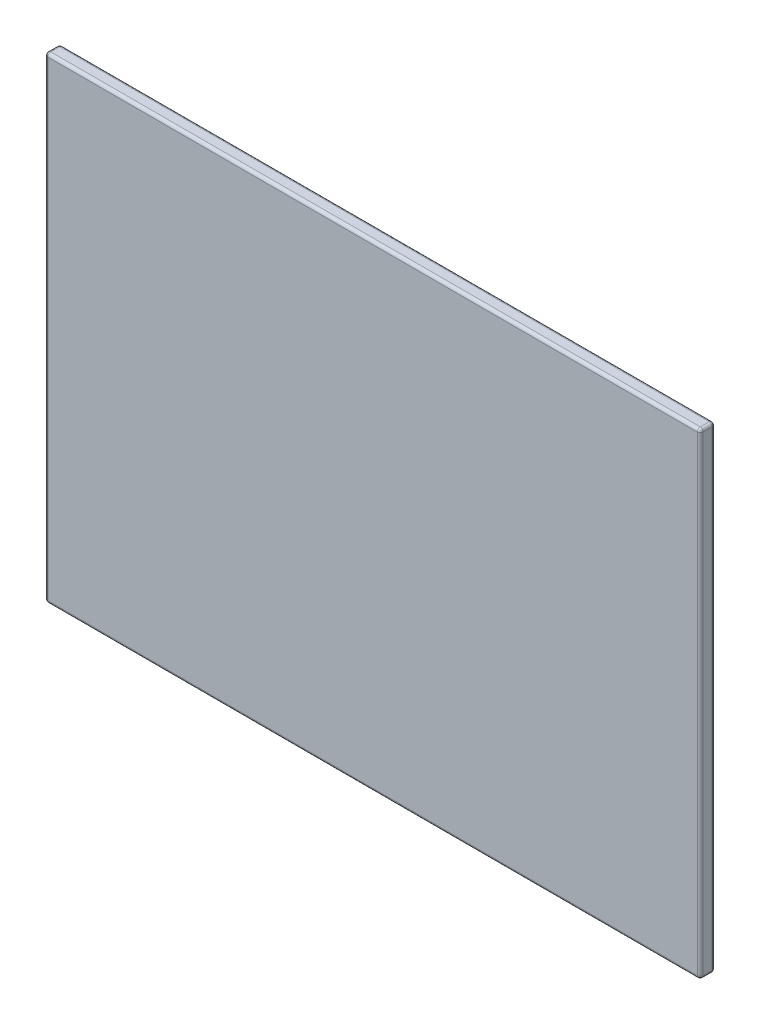
ISO-10303-21;
HEADER;
FILE_DESCRIPTION(('STEP AP214'),'2;1');
FILE_NAME('part.step','',(''),(''),'','','');
FILE_SCHEMA(('AUTOMOTIVE_DESIGN { 1 0 10303 214 1 1 1 1 }'));
ENDSEC;
DATA;
#1=APPLICATION_CONTEXT('core data for automotive mechanical design processes');
#2=APPLICATION_PROTOCOL_DEFINITION('international standard','automotive_design',2000,#1);
#3=PRODUCT_CONTEXT('',#1,'mechanical');
#4=PRODUCT('Part','Part','',(#3));
#5=PRODUCT_RELATED_PRODUCT_CATEGORY('part','',(#4));
#6=PRODUCT_DEFINITION_FORMATION('','',#4);
#7=PRODUCT_DEFINITION_CONTEXT('part definition',#1,'design');
#8=PRODUCT_DEFINITION('design','',#6,#7);
#9=PRODUCT_DEFINITION_SHAPE('','',#8);
#10=(LENGTH_UNIT() NAMED_UNIT(*) SI_UNIT(.MILLI.,.METRE.));
#11=(NAMED_UNIT(*) PLANE_ANGLE_UNIT() SI_UNIT($,.RADIAN.));
#12=(NAMED_UNIT(*) SI_UNIT($,.STERADIAN.) SOLID_ANGLE_UNIT());
#13=UNCERTAINTY_MEASURE_WITH_UNIT(LENGTH_MEASURE(1.E-05),#10,'distance_accuracy_value','');
#14=(GEOMETRIC_REPRESENTATION_CONTEXT(3) GLOBAL_UNCERTAINTY_ASSIGNED_CONTEXT((#13)) GLOBAL_UNIT_ASSIGNED_CONTEXT((#10,
#11,#12)) REPRESENTATION_CONTEXT('',''));
#15=CARTESIAN_POINT('',(0.,0.,0.));
#16=DIRECTION('',(0.,0.,1.));
#17=DIRECTION('',(1.,0.,0.));
#18=AXIS2_PLACEMENT_3D('',#15,#16,#17);
#19=CARTESIAN_POINT('',(-1.09,-0.79,0.04));
#20=DIRECTION('',(-0.577350269189626,-0.577350269189626,0.577350269189626));
#21=DIRECTION('',(0.,0.707106781186548,0.707106781186548));
#22=AXIS2_PLACEMENT_3D('',#19,#20,#21);
#23=SPHERICAL_SURFACE('',#22,0.01);
#24=CARTESIAN_POINT('',(-1.0957735026919,-0.795773502691896,0.0457735026918962));
#25=VERTEX_POINT('',#24);
#26=VERTEX_LOOP('',#25);
#27=FACE_BOUND('',#26,.T.);
#28=CARTESIAN_POINT('',(-1.09,-0.79,0.04));
#29=DIRECTION('',(0.,0.,1.));
#30=DIRECTION('',(1.,0.,0.));
#31=AXIS2_PLACEMENT_3D('',#28,#29,#30);
#32=CIRCLE('',#31,0.01);
#33=CARTESIAN_POINT('',(-1.09,-0.8,0.04));
#34=VERTEX_POINT('',#33);
#35=CARTESIAN_POINT('',(-1.1,-0.79,0.04));
#36=VERTEX_POINT('',#35);
#37=EDGE_CURVE('E112',#34,#36,#32,.F.);
#38=ORIENTED_EDGE('',*,*,#37,.F.);
#39=CARTESIAN_POINT('',(-1.09,-0.79,0.04));
#40=DIRECTION('',(1.,0.,0.));
#41=DIRECTION('',(0.,1.,0.));
#42=AXIS2_PLACEMENT_3D('',#39,#40,#41);
#43=CIRCLE('',#42,0.01);
#44=CARTESIAN_POINT('',(-1.09,-0.79,0.05));
#45=VERTEX_POINT('',#44);
#46=EDGE_CURVE('E123',#45,#34,#43,.T.);
#47=ORIENTED_EDGE('',*,*,#46,.F.);
#48=CARTESIAN_POINT('',(-1.09,-0.79,0.04));
#49=DIRECTION('',(0.,-1.,0.));
#50=DIRECTION('',(1.,0.,0.));
#51=AXIS2_PLACEMENT_3D('',#48,#49,#50);
#52=CIRCLE('',#51,0.01);
#53=EDGE_CURVE('E21',#36,#45,#52,.F.);
#54=ORIENTED_EDGE('',*,*,#53,.F.);
#55=EDGE_LOOP('',(#38,#47,#54));
#56=FACE_BOUND('',#55,.T.);
#57=ADVANCED_FACE('F17',(#27,#56),#23,.T.);
#58=CARTESIAN_POINT('',(1.09,-0.79,0.04));
#59=DIRECTION('',(0.577350269189626,-0.577350269189626,0.577350269189626));
#60=DIRECTION('',(0.,0.707106781186548,0.707106781186548));
#61=AXIS2_PLACEMENT_3D('',#58,#59,#60);
#62=SPHERICAL_SURFACE('',#61,0.01);
#63=CARTESIAN_POINT('',(1.0957735026919,-0.795773502691896,0.0457735026918962));
#64=VERTEX_POINT('',#63);
#65=VERTEX_LOOP('',#64);
#66=FACE_BOUND('',#65,.T.);
#67=CARTESIAN_POINT('',(1.09,-0.79,0.04));
#68=DIRECTION('',(0.,0.,1.));
#69=DIRECTION('',(1.,0.,0.));
#70=AXIS2_PLACEMENT_3D('',#67,#68,#69);
#71=CIRCLE('',#70,0.01);
#72=CARTESIAN_POINT('',(1.1,-0.79,0.04));
#73=VERTEX_POINT('',#72);
#74=CARTESIAN_POINT('',(1.09,-0.8,0.04));
#75=VERTEX_POINT('',#74);
#76=EDGE_CURVE('E224',#73,#75,#71,.F.);
#77=ORIENTED_EDGE('',*,*,#76,.F.);
#78=CARTESIAN_POINT('',(1.09,-0.79,0.04));
#79=DIRECTION('',(0.,1.,0.));
#80=DIRECTION('',(-1.,0.,0.));
#81=AXIS2_PLACEMENT_3D('',#78,#79,#80);
#82=CIRCLE('',#81,0.01);
#83=CARTESIAN_POINT('',(1.09,-0.79,0.05));
#84=VERTEX_POINT('',#83);
#85=EDGE_CURVE('E175',#84,#73,#82,.T.);
#86=ORIENTED_EDGE('',*,*,#85,.F.);
#87=CARTESIAN_POINT('',(1.09,-0.79,0.04));
#88=DIRECTION('',(1.,0.,0.));
#89=DIRECTION('',(0.,1.,0.));
#90=AXIS2_PLACEMENT_3D('',#87,#88,#89);
#91=CIRCLE('',#90,0.01);
#92=EDGE_CURVE('E180',#75,#84,#91,.F.);
#93=ORIENTED_EDGE('',*,*,#92,.F.);
#94=EDGE_LOOP('',(#77,#86,#93));
#95=FACE_BOUND('',#94,.T.);
#96=ADVANCED_FACE('F167',(#66,#95),#62,.T.);
#97=CARTESIAN_POINT('',(-1.09,0.79,0.04));
#98=DIRECTION('',(-0.577350269189626,0.577350269189626,0.577350269189626));
#99=DIRECTION('',(0.,0.707106781186548,-0.707106781186548));
#100=AXIS2_PLACEMENT_3D('',#97,#98,#99);
#101=SPHERICAL_SURFACE('',#100,0.01);
#102=CARTESIAN_POINT('',(-1.0957735026919,0.795773502691896,0.0457735026918962));
#103=VERTEX_POINT('',#102);
#104=VERTEX_LOOP('',#103);
#105=FACE_BOUND('',#104,.T.);
#106=CARTESIAN_POINT('',(-1.09,0.79,0.04));
#107=DIRECTION('',(0.,0.,1.));
#108=DIRECTION('',(1.,0.,0.));
#109=AXIS2_PLACEMENT_3D('',#106,#107,#108);
#110=CIRCLE('',#109,0.01);
#111=CARTESIAN_POINT('',(-1.1,0.79,0.04));
#112=VERTEX_POINT('',#111);
#113=CARTESIAN_POINT('',(-1.09,0.8,0.04));
#114=VERTEX_POINT('',#113);
#115=EDGE_CURVE('E222',#112,#114,#110,.F.);
#116=ORIENTED_EDGE('',*,*,#115,.F.);
#117=CARTESIAN_POINT('',(-1.09,0.79,0.04));
#118=DIRECTION('',(0.,-1.,0.));
#119=DIRECTION('',(1.,0.,0.));
#120=AXIS2_PLACEMENT_3D('',#117,#118,#119);
#121=CIRCLE('',#120,0.01);
#122=CARTESIAN_POINT('',(-1.09,0.79,0.05));
#123=VERTEX_POINT('',#122);
#124=EDGE_CURVE('E141',#123,#112,#121,.T.);
#125=ORIENTED_EDGE('',*,*,#124,.F.);
#126=CARTESIAN_POINT('',(-1.09,0.79,0.04));
#127=DIRECTION('',(-1.,0.,0.));
#128=DIRECTION('',(0.,-1.,0.));
#129=AXIS2_PLACEMENT_3D('',#126,#127,#128);
#130=CIRCLE('',#129,0.01);
#131=EDGE_CURVE('E219',#114,#123,#130,.F.);
#132=ORIENTED_EDGE('',*,*,#131,.F.);
#133=EDGE_LOOP('',(#116,#125,#132));
#134=FACE_BOUND('',#133,.T.);
#135=ADVANCED_FACE('F164',(#105,#134),#101,.T.);
#136=CARTESIAN_POINT('',(0.,0.,0.05));
#137=DIRECTION('',(0.,0.,1.));
#138=DIRECTION('',(1.,0.,0.));
#139=AXIS2_PLACEMENT_3D('',#136,#137,#138);
#140=PLANE('',#139);
#141=DIRECTION('',(0.,1.,0.));
#142=VECTOR('',#141,1.);
#143=CARTESIAN_POINT('',(1.09,-0.4,0.05));
#144=LINE('',#143,#142);
#145=CARTESIAN_POINT('',(1.09,0.79,0.05));
#146=VERTEX_POINT('',#145);
#147=EDGE_CURVE('E173',#146,#84,#144,.F.);
#148=ORIENTED_EDGE('',*,*,#147,.F.);
#149=DIRECTION('',(-1.,0.,0.));
#150=VECTOR('',#149,1.);
#151=CARTESIAN_POINT('',(0.55,0.79,0.05));
#152=LINE('',#151,#150);
#153=EDGE_CURVE('E152',#123,#146,#152,.F.);
#154=ORIENTED_EDGE('',*,*,#153,.F.);
#155=DIRECTION('',(0.,-1.,0.));
#156=VECTOR('',#155,1.);
#157=CARTESIAN_POINT('',(-1.09,0.4,0.05));
#158=LINE('',#157,#156);
#159=EDGE_CURVE('E138',#45,#123,#158,.F.);
#160=ORIENTED_EDGE('',*,*,#159,.F.);
#161=DIRECTION('',(1.,0.,0.));
#162=VECTOR('',#161,1.);
#163=CARTESIAN_POINT('',(-0.55,-0.79,0.05));
#164=LINE('',#163,#162);
#165=EDGE_CURVE('E178',#84,#45,#164,.F.);
#166=ORIENTED_EDGE('',*,*,#165,.F.);
#167=EDGE_LOOP('',(#148,#154,#160,#166));
#168=FACE_BOUND('',#167,.T.);
#169=ADVANCED_FACE('F159',(#168),#140,.T.);
#170=CARTESIAN_POINT('',(1.09,0.79,0.04));
#171=DIRECTION('',(0.577350269189626,0.577350269189626,0.577350269189626));
#172=DIRECTION('',(0.,0.707106781186548,-0.707106781186548));
#173=AXIS2_PLACEMENT_3D('',#170,#171,#172);
#174=SPHERICAL_SURFACE('',#173,0.01);
#175=CARTESIAN_POINT('',(1.0957735026919,0.795773502691896,0.0457735026918962));
#176=VERTEX_POINT('',#175);
#177=VERTEX_LOOP('',#176);
#178=FACE_BOUND('',#177,.T.);
#179=CARTESIAN_POINT('',(1.09,0.79,0.04));
#180=DIRECTION('',(0.,0.,1.));
#181=DIRECTION('',(1.,0.,0.));
#182=AXIS2_PLACEMENT_3D('',#179,#180,#181);
#183=CIRCLE('',#182,0.01);
#184=CARTESIAN_POINT('',(1.09,0.8,0.04));
#185=VERTEX_POINT('',#184);
#186=CARTESIAN_POINT('',(1.1,0.79,0.04));
#187=VERTEX_POINT('',#186);
#188=EDGE_CURVE('E133',#185,#187,#183,.F.);
#189=ORIENTED_EDGE('',*,*,#188,.F.);
#190=CARTESIAN_POINT('',(1.09,0.79,0.04));
#191=DIRECTION('',(-1.,0.,0.));
#192=DIRECTION('',(0.,-1.,0.));
#193=AXIS2_PLACEMENT_3D('',#190,#191,#192);
#194=CIRCLE('',#193,0.01);
#195=EDGE_CURVE('E217',#146,#185,#194,.T.);
#196=ORIENTED_EDGE('',*,*,#195,.F.);
#197=CARTESIAN_POINT('',(1.09,0.79,0.04));
#198=DIRECTION('',(0.,1.,0.));
#199=DIRECTION('',(-1.,0.,0.));
#200=AXIS2_PLACEMENT_3D('',#197,#198,#199);
#201=CIRCLE('',#200,0.01);
#202=EDGE_CURVE('E122',#187,#146,#201,.F.);
#203=ORIENTED_EDGE('',*,*,#202,.F.);
#204=EDGE_LOOP('',(#189,#196,#203));
#205=FACE_BOUND('',#204,.T.);
#206=ADVANCED_FACE('F155',(#178,#205),#174,.T.);
#207=CARTESIAN_POINT('',(-1.09,0.4,0.04));
#208=DIRECTION('',(0.,-1.,0.));
#209=DIRECTION('',(1.,0.,0.));
#210=AXIS2_PLACEMENT_3D('',#207,#208,#209);
#211=CYLINDRICAL_SURFACE('',#210,0.01);
#212=ORIENTED_EDGE('',*,*,#124,.T.);
#213=DIRECTION('',(0.,-1.,0.));
#214=VECTOR('',#213,1.);
#215=CARTESIAN_POINT('',(-1.1,0.8,0.04));
#216=LINE('',#215,#214);
#217=EDGE_CURVE('E129',#36,#112,#216,.F.);
#218=ORIENTED_EDGE('',*,*,#217,.F.);
#219=ORIENTED_EDGE('',*,*,#53,.T.);
#220=ORIENTED_EDGE('',*,*,#159,.T.);
#221=EDGE_LOOP('',(#212,#218,#219,#220));
#222=FACE_BOUND('',#221,.T.);
#223=ADVANCED_FACE('F139',(#222),#211,.T.);
#224=CARTESIAN_POINT('',(-0.55,-0.79,0.04));
#225=DIRECTION('',(1.,0.,0.));
#226=DIRECTION('',(0.,1.,0.));
#227=AXIS2_PLACEMENT_3D('',#224,#225,#226);
#228=CYLINDRICAL_SURFACE('',#227,0.01);
#229=ORIENTED_EDGE('',*,*,#46,.T.);
#230=DIRECTION('',(1.,0.,0.));
#231=VECTOR('',#230,1.);
#232=CARTESIAN_POINT('',(-1.1,-0.8,0.04));
#233=LINE('',#232,#231);
#234=EDGE_CURVE('E148',#75,#34,#233,.F.);
#235=ORIENTED_EDGE('',*,*,#234,.F.);
#236=ORIENTED_EDGE('',*,*,#92,.T.);
#237=ORIENTED_EDGE('',*,*,#165,.T.);
#238=EDGE_LOOP('',(#229,#235,#236,#237));
#239=FACE_BOUND('',#238,.T.);
#240=ADVANCED_FACE('F233',(#239),#228,.T.);
#241=CARTESIAN_POINT('',(-1.09,-0.79,0.));
#242=DIRECTION('',(0.,0.,1.));
#243=DIRECTION('',(1.,0.,0.));
#244=AXIS2_PLACEMENT_3D('',#241,#242,#243);
#245=CYLINDRICAL_SURFACE('',#244,0.01);
#246=CARTESIAN_POINT('',(-1.09,-0.79,0.01));
#247=DIRECTION('',(0.,0.,1.));
#248=DIRECTION('',(1.,0.,0.));
#249=AXIS2_PLACEMENT_3D('',#246,#247,#248);
#250=CIRCLE('',#249,0.01);
#251=CARTESIAN_POINT('',(-1.09,-0.8,0.01));
#252=VERTEX_POINT('',#251);
#253=CARTESIAN_POINT('',(-1.1,-0.79,0.01));
#254=VERTEX_POINT('',#253);
#255=EDGE_CURVE('E144',#252,#254,#250,.F.);
#256=ORIENTED_EDGE('',*,*,#255,.F.);
#257=DIRECTION('',(0.,0.,1.));
#258=VECTOR('',#257,1.);
#259=CARTESIAN_POINT('',(-1.09,-0.8,0.));
#260=LINE('',#259,#258);
#261=EDGE_CURVE('E118',#34,#252,#260,.F.);
#262=ORIENTED_EDGE('',*,*,#261,.F.);
#263=ORIENTED_EDGE('',*,*,#37,.T.);
#264=DIRECTION('',(0.,0.,1.));
#265=VECTOR('',#264,1.);
#266=CARTESIAN_POINT('',(-1.1,-0.79,0.));
#267=LINE('',#266,#265);
#268=EDGE_CURVE('E116',#254,#36,#267,.T.);
#269=ORIENTED_EDGE('',*,*,#268,.F.);
#270=EDGE_LOOP('',(#256,#262,#263,#269));
#271=FACE_BOUND('',#270,.T.);
#272=ADVANCED_FACE('F115',(#271),#245,.T.);
#273=CARTESIAN_POINT('',(1.09,-0.4,0.04));
#274=DIRECTION('',(0.,1.,0.));
#275=DIRECTION('',(-1.,0.,0.));
#276=AXIS2_PLACEMENT_3D('',#273,#274,#275);
#277=CYLINDRICAL_SURFACE('',#276,0.01);
#278=ORIENTED_EDGE('',*,*,#85,.T.);
#279=DIRECTION('',(0.,1.,0.));
#280=VECTOR('',#279,1.);
#281=CARTESIAN_POINT('',(1.1,-0.8,0.04));
#282=LINE('',#281,#280);
#283=EDGE_CURVE('E318',#187,#73,#282,.F.);
#284=ORIENTED_EDGE('',*,*,#283,.F.);
#285=ORIENTED_EDGE('',*,*,#202,.T.);
#286=ORIENTED_EDGE('',*,*,#147,.T.);
#287=EDGE_LOOP('',(#278,#284,#285,#286));
#288=FACE_BOUND('',#287,.T.);
#289=ADVANCED_FACE('F244',(#288),#277,.T.);
#290=CARTESIAN_POINT('',(1.09,-0.79,0.));
#291=DIRECTION('',(0.,0.,1.));
#292=DIRECTION('',(1.,0.,0.));
#293=AXIS2_PLACEMENT_3D('',#290,#291,#292);
#294=CYLINDRICAL_SURFACE('',#293,0.01);
#295=CARTESIAN_POINT('',(1.09,-0.79,0.01));
#296=DIRECTION('',(0.,0.,1.));
#297=DIRECTION('',(1.,0.,0.));
#298=AXIS2_PLACEMENT_3D('',#295,#296,#297);
#299=CIRCLE('',#298,0.01);
#300=CARTESIAN_POINT('',(1.1,-0.79,0.01));
#301=VERTEX_POINT('',#300);
#302=CARTESIAN_POINT('',(1.09,-0.8,0.01));
#303=VERTEX_POINT('',#302);
#304=EDGE_CURVE('E211',#301,#303,#299,.F.);
#305=ORIENTED_EDGE('',*,*,#304,.F.);
#306=DIRECTION('',(0.,0.,1.));
#307=VECTOR('',#306,1.);
#308=CARTESIAN_POINT('',(1.1,-0.79,0.));
#309=LINE('',#308,#307);
#310=EDGE_CURVE('E210',#73,#301,#309,.F.);
#311=ORIENTED_EDGE('',*,*,#310,.F.);
#312=ORIENTED_EDGE('',*,*,#76,.T.);
#313=DIRECTION('',(0.,0.,1.));
#314=VECTOR('',#313,1.);
#315=CARTESIAN_POINT('',(1.09,-0.8,0.));
#316=LINE('',#315,#314);
#317=EDGE_CURVE('E215',#303,#75,#316,.T.);
#318=ORIENTED_EDGE('',*,*,#317,.F.);
#319=EDGE_LOOP('',(#305,#311,#312,#318));
#320=FACE_BOUND('',#319,.T.);
#321=ADVANCED_FACE('F352',(#320),#294,.T.);
#322=CARTESIAN_POINT('',(-1.09,0.79,0.));
#323=DIRECTION('',(0.,0.,1.));
#324=DIRECTION('',(1.,0.,0.));
#325=AXIS2_PLACEMENT_3D('',#322,#323,#324);
#326=CYLINDRICAL_SURFACE('',#325,0.01);
#327=CARTESIAN_POINT('',(-1.09,0.79,0.01));
#328=DIRECTION('',(0.,0.,1.));
#329=DIRECTION('',(1.,0.,0.));
#330=AXIS2_PLACEMENT_3D('',#327,#328,#329);
#331=CIRCLE('',#330,0.01);
#332=CARTESIAN_POINT('',(-1.1,0.79,0.01));
#333=VERTEX_POINT('',#332);
#334=CARTESIAN_POINT('',(-1.09,0.8,0.01));
#335=VERTEX_POINT('',#334);
#336=EDGE_CURVE('E205',#333,#335,#331,.F.);
#337=ORIENTED_EDGE('',*,*,#336,.F.);
#338=DIRECTION('',(0.,0.,1.));
#339=VECTOR('',#338,1.);
#340=CARTESIAN_POINT('',(-1.1,0.79,0.));
#341=LINE('',#340,#339);
#342=EDGE_CURVE('E142',#112,#333,#341,.F.);
#343=ORIENTED_EDGE('',*,*,#342,.F.);
#344=ORIENTED_EDGE('',*,*,#115,.T.);
#345=DIRECTION('',(0.,0.,1.));
#346=VECTOR('',#345,1.);
#347=CARTESIAN_POINT('',(-1.09,0.8,0.));
#348=LINE('',#347,#346);
#349=EDGE_CURVE('E207',#335,#114,#348,.T.);
#350=ORIENTED_EDGE('',*,*,#349,.F.);
#351=EDGE_LOOP('',(#337,#343,#344,#350));
#352=FACE_BOUND('',#351,.T.);
#353=ADVANCED_FACE('F374',(#352),#326,.T.);
#354=CARTESIAN_POINT('',(0.55,0.79,0.04));
#355=DIRECTION('',(-1.,0.,0.));
#356=DIRECTION('',(0.,-1.,0.));
#357=AXIS2_PLACEMENT_3D('',#354,#355,#356);
#358=CYLINDRICAL_SURFACE('',#357,0.01);
#359=ORIENTED_EDGE('',*,*,#195,.T.);
#360=DIRECTION('',(-1.,0.,0.));
#361=VECTOR('',#360,1.);
#362=CARTESIAN_POINT('',(1.1,0.8,0.04));
#363=LINE('',#362,#361);
#364=EDGE_CURVE('E310',#114,#185,#363,.F.);
#365=ORIENTED_EDGE('',*,*,#364,.F.);
#366=ORIENTED_EDGE('',*,*,#131,.T.);
#367=ORIENTED_EDGE('',*,*,#153,.T.);
#368=EDGE_LOOP('',(#359,#365,#366,#367));
#369=FACE_BOUND('',#368,.T.);
#370=ADVANCED_FACE('F421',(#369),#358,.T.);
#371=CARTESIAN_POINT('',(1.09,0.79,0.));
#372=DIRECTION('',(0.,0.,1.));
#373=DIRECTION('',(1.,0.,0.));
#374=AXIS2_PLACEMENT_3D('',#371,#372,#373);
#375=CYLINDRICAL_SURFACE('',#374,0.01);
#376=CARTESIAN_POINT('',(1.09,0.79,0.01));
#377=DIRECTION('',(0.,0.,1.));
#378=DIRECTION('',(1.,0.,0.));
#379=AXIS2_PLACEMENT_3D('',#376,#377,#378);
#380=CIRCLE('',#379,0.01);
#381=CARTESIAN_POINT('',(1.09,0.8,0.01));
#382=VERTEX_POINT('',#381);
#383=CARTESIAN_POINT('',(1.1,0.79,0.01));
#384=VERTEX_POINT('',#383);
#385=EDGE_CURVE('E208',#382,#384,#380,.F.);
#386=ORIENTED_EDGE('',*,*,#385,.F.);
#387=DIRECTION('',(0.,0.,1.));
#388=VECTOR('',#387,1.);
#389=CARTESIAN_POINT('',(1.09,0.8,0.));
#390=LINE('',#389,#388);
#391=EDGE_CURVE('E204',#185,#382,#390,.F.);
#392=ORIENTED_EDGE('',*,*,#391,.F.);
#393=ORIENTED_EDGE('',*,*,#188,.T.);
#394=DIRECTION('',(0.,0.,1.));
#395=VECTOR('',#394,1.);
#396=CARTESIAN_POINT('',(1.1,0.79,0.));
#397=LINE('',#396,#395);
#398=EDGE_CURVE('E213',#384,#187,#397,.T.);
#399=ORIENTED_EDGE('',*,*,#398,.F.);
#400=EDGE_LOOP('',(#386,#392,#393,#399));
#401=FACE_BOUND('',#400,.T.);
#402=ADVANCED_FACE('F382',(#401),#375,.T.);
#403=CARTESIAN_POINT('',(-1.1,0.8,0.));
#404=DIRECTION('',(-1.,0.,0.));
#405=DIRECTION('',(0.,-1.,0.));
#406=AXIS2_PLACEMENT_3D('',#403,#404,#405);
#407=PLANE('',#406);
#408=ORIENTED_EDGE('',*,*,#342,.T.);
#409=DIRECTION('',(0.,1.,0.));
#410=VECTOR('',#409,1.);
#411=CARTESIAN_POINT('',(-1.1,0.4,0.01));
#412=LINE('',#411,#410);
#413=EDGE_CURVE('E132',#254,#333,#412,.T.);
#414=ORIENTED_EDGE('',*,*,#413,.F.);
#415=ORIENTED_EDGE('',*,*,#268,.T.);
#416=ORIENTED_EDGE('',*,*,#217,.T.);
#417=EDGE_LOOP('',(#408,#414,#415,#416));
#418=FACE_BOUND('',#417,.T.);
#419=ADVANCED_FACE('F127',(#418),#407,.T.);
#420=CARTESIAN_POINT('',(-1.09,-0.79,0.01));
#421=DIRECTION('',(-0.577350269189626,-0.577350269189626,-0.577350269189626));
#422=DIRECTION('',(0.,-0.707106781186548,0.707106781186548));
#423=AXIS2_PLACEMENT_3D('',#420,#421,#422);
#424=SPHERICAL_SURFACE('',#423,0.01);
#425=CARTESIAN_POINT('',(-1.0957735026919,-0.795773502691896,0.00422649730810376));
#426=VERTEX_POINT('',#425);
#427=VERTEX_LOOP('',#426);
#428=FACE_BOUND('',#427,.T.);
#429=CARTESIAN_POINT('',(-1.09,-0.79,0.01));
#430=DIRECTION('',(-1.,0.,0.));
#431=DIRECTION('',(0.,-1.,0.));
#432=AXIS2_PLACEMENT_3D('',#429,#430,#431);
#433=CIRCLE('',#432,0.01);
#434=CARTESIAN_POINT('',(-1.09,-0.79,0.));
#435=VERTEX_POINT('',#434);
#436=EDGE_CURVE('E197',#252,#435,#433,.F.);
#437=ORIENTED_EDGE('',*,*,#436,.F.);
#438=ORIENTED_EDGE('',*,*,#255,.T.);
#439=CARTESIAN_POINT('',(-1.09,-0.79,0.01));
#440=DIRECTION('',(0.,1.,0.));
#441=DIRECTION('',(-1.,0.,0.));
#442=AXIS2_PLACEMENT_3D('',#439,#440,#441);
#443=CIRCLE('',#442,0.01);
#444=EDGE_CURVE('E199',#435,#254,#443,.T.);
#445=ORIENTED_EDGE('',*,*,#444,.F.);
#446=EDGE_LOOP('',(#437,#438,#445));
#447=FACE_BOUND('',#446,.T.);
#448=ADVANCED_FACE('F333',(#428,#447),#424,.T.);
#449=CARTESIAN_POINT('',(-1.1,-0.8,0.));
#450=DIRECTION('',(0.,-1.,0.));
#451=DIRECTION('',(1.,0.,0.));
#452=AXIS2_PLACEMENT_3D('',#449,#450,#451);
#453=PLANE('',#452);
#454=ORIENTED_EDGE('',*,*,#234,.T.);
#455=ORIENTED_EDGE('',*,*,#261,.T.);
#456=DIRECTION('',(-1.,0.,0.));
#457=VECTOR('',#456,1.);
#458=CARTESIAN_POINT('',(-0.55,-0.8,0.01));
#459=LINE('',#458,#457);
#460=EDGE_CURVE('E193',#303,#252,#459,.T.);
#461=ORIENTED_EDGE('',*,*,#460,.F.);
#462=ORIENTED_EDGE('',*,*,#317,.T.);
#463=EDGE_LOOP('',(#454,#455,#461,#462));
#464=FACE_BOUND('',#463,.T.);
#465=ADVANCED_FACE('F329',(#464),#453,.T.);
#466=CARTESIAN_POINT('',(1.09,-0.79,0.01));
#467=DIRECTION('',(0.577350269189626,-0.577350269189626,-0.577350269189626));
#468=DIRECTION('',(0.,-0.707106781186548,0.707106781186548));
#469=AXIS2_PLACEMENT_3D('',#466,#467,#468);
#470=SPHERICAL_SURFACE('',#469,0.01);
#471=CARTESIAN_POINT('',(1.0957735026919,-0.795773502691896,0.00422649730810376));
#472=VERTEX_POINT('',#471);
#473=VERTEX_LOOP('',#472);
#474=FACE_BOUND('',#473,.T.);
#475=CARTESIAN_POINT('',(1.09,-0.79,0.01));
#476=DIRECTION('',(0.,-1.,0.));
#477=DIRECTION('',(1.,0.,0.));
#478=AXIS2_PLACEMENT_3D('',#475,#476,#477);
#479=CIRCLE('',#478,0.01);
#480=CARTESIAN_POINT('',(1.09,-0.79,0.));
#481=VERTEX_POINT('',#480);
#482=EDGE_CURVE('E191',#301,#481,#479,.F.);
#483=ORIENTED_EDGE('',*,*,#482,.F.);
#484=ORIENTED_EDGE('',*,*,#304,.T.);
#485=CARTESIAN_POINT('',(1.09,-0.79,0.01));
#486=DIRECTION('',(-1.,0.,0.));
#487=DIRECTION('',(0.,-1.,0.));
#488=AXIS2_PLACEMENT_3D('',#485,#486,#487);
#489=CIRCLE('',#488,0.01);
#490=EDGE_CURVE('E194',#481,#303,#489,.T.);
#491=ORIENTED_EDGE('',*,*,#490,.F.);
#492=EDGE_LOOP('',(#483,#484,#491));
#493=FACE_BOUND('',#492,.T.);
#494=ADVANCED_FACE('F325',(#474,#493),#470,.T.);
#495=CARTESIAN_POINT('',(1.1,-0.8,0.));
#496=DIRECTION('',(1.,0.,0.));
#497=DIRECTION('',(0.,1.,0.));
#498=AXIS2_PLACEMENT_3D('',#495,#496,#497);
#499=PLANE('',#498);
#500=ORIENTED_EDGE('',*,*,#310,.T.);
#501=DIRECTION('',(0.,-1.,0.));
#502=VECTOR('',#501,1.);
#503=CARTESIAN_POINT('',(1.1,-0.4,0.01));
#504=LINE('',#503,#502);
#505=EDGE_CURVE('E187',#384,#301,#504,.T.);
#506=ORIENTED_EDGE('',*,*,#505,.F.);
#507=ORIENTED_EDGE('',*,*,#398,.T.);
#508=ORIENTED_EDGE('',*,*,#283,.T.);
#509=EDGE_LOOP('',(#500,#506,#507,#508));
#510=FACE_BOUND('',#509,.T.);
#511=ADVANCED_FACE('F328',(#510),#499,.T.);
#512=CARTESIAN_POINT('',(1.09,0.79,0.01));
#513=DIRECTION('',(0.577350269189626,0.577350269189626,-0.577350269189626));
#514=DIRECTION('',(0.,-0.707106781186548,-0.707106781186548));
#515=AXIS2_PLACEMENT_3D('',#512,#513,#514);
#516=SPHERICAL_SURFACE('',#515,0.01);
#517=CARTESIAN_POINT('',(1.0957735026919,0.795773502691896,0.00422649730810376));
#518=VERTEX_POINT('',#517);
#519=VERTEX_LOOP('',#518);
#520=FACE_BOUND('',#519,.T.);
#521=CARTESIAN_POINT('',(1.09,0.79,0.01));
#522=DIRECTION('',(1.,0.,0.));
#523=DIRECTION('',(0.,1.,0.));
#524=AXIS2_PLACEMENT_3D('',#521,#522,#523);
#525=CIRCLE('',#524,0.01);
#526=CARTESIAN_POINT('',(1.09,0.79,0.));
#527=VERTEX_POINT('',#526);
#528=EDGE_CURVE('E35',#382,#527,#525,.F.);
#529=ORIENTED_EDGE('',*,*,#528,.F.);
#530=ORIENTED_EDGE('',*,*,#385,.T.);
#531=CARTESIAN_POINT('',(1.09,0.79,0.01));
#532=DIRECTION('',(0.,-1.,0.));
#533=DIRECTION('',(1.,0.,0.));
#534=AXIS2_PLACEMENT_3D('',#531,#532,#533);
#535=CIRCLE('',#534,0.01);
#536=EDGE_CURVE('E188',#527,#384,#535,.T.);
#537=ORIENTED_EDGE('',*,*,#536,.F.);
#538=EDGE_LOOP('',(#529,#530,#537));
#539=FACE_BOUND('',#538,.T.);
#540=ADVANCED_FACE('F298',(#520,#539),#516,.T.);
#541=CARTESIAN_POINT('',(-1.09,0.79,0.01));
#542=DIRECTION('',(-0.577350269189626,0.577350269189626,-0.577350269189626));
#543=DIRECTION('',(0.707106781186548,0.707106781186548,0.));
#544=AXIS2_PLACEMENT_3D('',#541,#542,#543);
#545=SPHERICAL_SURFACE('',#544,0.01);
#546=CARTESIAN_POINT('',(-1.0957735026919,0.795773502691896,0.00422649730810376));
#547=VERTEX_POINT('',#546);
#548=VERTEX_LOOP('',#547);
#549=FACE_BOUND('',#548,.T.);
#550=CARTESIAN_POINT('',(-1.09,0.79,0.01));
#551=DIRECTION('',(1.,0.,0.));
#552=DIRECTION('',(0.,1.,0.));
#553=AXIS2_PLACEMENT_3D('',#550,#551,#552);
#554=CIRCLE('',#553,0.01);
#555=CARTESIAN_POINT('',(-1.09,0.79,0.));
#556=VERTEX_POINT('',#555);
#557=EDGE_CURVE('E182',#556,#335,#554,.T.);
#558=ORIENTED_EDGE('',*,*,#557,.F.);
#559=CARTESIAN_POINT('',(-1.09,0.79,0.01));
#560=DIRECTION('',(0.,1.,0.));
#561=DIRECTION('',(-1.,0.,0.));
#562=AXIS2_PLACEMENT_3D('',#559,#560,#561);
#563=CIRCLE('',#562,0.01);
#564=EDGE_CURVE('E202',#333,#556,#563,.F.);
#565=ORIENTED_EDGE('',*,*,#564,.F.);
#566=ORIENTED_EDGE('',*,*,#336,.T.);
#567=EDGE_LOOP('',(#558,#565,#566));
#568=FACE_BOUND('',#567,.T.);
#569=ADVANCED_FACE('F293',(#549,#568),#545,.T.);
#570=CARTESIAN_POINT('',(1.1,0.8,0.));
#571=DIRECTION('',(0.,1.,0.));
#572=DIRECTION('',(-1.,0.,0.));
#573=AXIS2_PLACEMENT_3D('',#570,#571,#572);
#574=PLANE('',#573);
#575=ORIENTED_EDGE('',*,*,#364,.T.);
#576=ORIENTED_EDGE('',*,*,#391,.T.);
#577=DIRECTION('',(1.,0.,0.));
#578=VECTOR('',#577,1.);
#579=CARTESIAN_POINT('',(0.55,0.8,0.01));
#580=LINE('',#579,#578);
#581=EDGE_CURVE('E185',#335,#382,#580,.T.);
#582=ORIENTED_EDGE('',*,*,#581,.F.);
#583=ORIENTED_EDGE('',*,*,#349,.T.);
#584=EDGE_LOOP('',(#575,#576,#582,#583));
#585=FACE_BOUND('',#584,.T.);
#586=ADVANCED_FACE('F289',(#585),#574,.T.);
#587=CARTESIAN_POINT('',(-1.09,0.4,0.01));
#588=DIRECTION('',(0.,1.,0.));
#589=DIRECTION('',(-1.,0.,0.));
#590=AXIS2_PLACEMENT_3D('',#587,#588,#589);
#591=CYLINDRICAL_SURFACE('',#590,0.01);
#592=ORIENTED_EDGE('',*,*,#444,.T.);
#593=ORIENTED_EDGE('',*,*,#413,.T.);
#594=ORIENTED_EDGE('',*,*,#564,.T.);
#595=DIRECTION('',(0.,1.,0.));
#596=VECTOR('',#595,1.);
#597=CARTESIAN_POINT('',(-1.09,0.,0.));
#598=LINE('',#597,#596);
#599=EDGE_CURVE('E304',#556,#435,#598,.F.);
#600=ORIENTED_EDGE('',*,*,#599,.T.);
#601=EDGE_LOOP('',(#592,#593,#594,#600));
#602=FACE_BOUND('',#601,.T.);
#603=ADVANCED_FACE('F285',(#602),#591,.T.);
#604=CARTESIAN_POINT('',(-0.55,-0.79,0.01));
#605=DIRECTION('',(-1.,0.,0.));
#606=DIRECTION('',(0.,-1.,0.));
#607=AXIS2_PLACEMENT_3D('',#604,#605,#606);
#608=CYLINDRICAL_SURFACE('',#607,0.01);
#609=ORIENTED_EDGE('',*,*,#490,.T.);
#610=ORIENTED_EDGE('',*,*,#460,.T.);
#611=ORIENTED_EDGE('',*,*,#436,.T.);
#612=DIRECTION('',(1.,0.,0.));
#613=VECTOR('',#612,1.);
#614=CARTESIAN_POINT('',(0.,-0.79,0.));
#615=LINE('',#614,#613);
#616=EDGE_CURVE('E306',#435,#481,#615,.T.);
#617=ORIENTED_EDGE('',*,*,#616,.T.);
#618=EDGE_LOOP('',(#609,#610,#611,#617));
#619=FACE_BOUND('',#618,.T.);
#620=ADVANCED_FACE('F281',(#619),#608,.T.);
#621=CARTESIAN_POINT('',(1.09,-0.4,0.01));
#622=DIRECTION('',(0.,-1.,0.));
#623=DIRECTION('',(1.,0.,0.));
#624=AXIS2_PLACEMENT_3D('',#621,#622,#623);
#625=CYLINDRICAL_SURFACE('',#624,0.01);
#626=ORIENTED_EDGE('',*,*,#536,.T.);
#627=ORIENTED_EDGE('',*,*,#505,.T.);
#628=ORIENTED_EDGE('',*,*,#482,.T.);
#629=DIRECTION('',(0.,1.,0.));
#630=VECTOR('',#629,1.);
#631=CARTESIAN_POINT('',(1.09,0.,0.));
#632=LINE('',#631,#630);
#633=EDGE_CURVE('E27',#481,#527,#632,.T.);
#634=ORIENTED_EDGE('',*,*,#633,.T.);
#635=EDGE_LOOP('',(#626,#627,#628,#634));
#636=FACE_BOUND('',#635,.T.);
#637=ADVANCED_FACE('F275',(#636),#625,.T.);
#638=CARTESIAN_POINT('',(0.55,0.79,0.01));
#639=DIRECTION('',(1.,0.,0.));
#640=DIRECTION('',(0.,1.,0.));
#641=AXIS2_PLACEMENT_3D('',#638,#639,#640);
#642=CYLINDRICAL_SURFACE('',#641,0.01);
#643=ORIENTED_EDGE('',*,*,#557,.T.);
#644=ORIENTED_EDGE('',*,*,#581,.T.);
#645=ORIENTED_EDGE('',*,*,#528,.T.);
#646=DIRECTION('',(1.,0.,0.));
#647=VECTOR('',#646,1.);
#648=CARTESIAN_POINT('',(0.,0.79,0.));
#649=LINE('',#648,#647);
#650=EDGE_CURVE('E11',#527,#556,#649,.F.);
#651=ORIENTED_EDGE('',*,*,#650,.T.);
#652=EDGE_LOOP('',(#643,#644,#645,#651));
#653=FACE_BOUND('',#652,.T.);
#654=ADVANCED_FACE('F269',(#653),#642,.T.);
#655=CARTESIAN_POINT('',(0.,0.,0.));
#656=DIRECTION('',(0.,0.,1.));
#657=DIRECTION('',(1.,0.,0.));
#658=AXIS2_PLACEMENT_3D('',#655,#656,#657);
#659=PLANE('',#658);
#660=ORIENTED_EDGE('',*,*,#633,.F.);
#661=ORIENTED_EDGE('',*,*,#616,.F.);
#662=ORIENTED_EDGE('',*,*,#599,.F.);
#663=ORIENTED_EDGE('',*,*,#650,.F.);
#664=EDGE_LOOP('',(#660,#661,#662,#663));
#665=FACE_BOUND('',#664,.T.);
#666=ADVANCED_FACE('F267',(#665),#659,.F.);
#667=CLOSED_SHELL('',(#57,#96,#135,#169,#206,#223,#240,#272,#289,#321,#353,#370,#402,#419,#448,
#465,#494,#511,#540,#569,#586,#603,#620,#637,#654,#666));
#668=MANIFOLD_SOLID_BREP('B1',#667);
#669=ADVANCED_BREP_SHAPE_REPRESENTATION('',(#18,#668),#14);
#670=SHAPE_DEFINITION_REPRESENTATION(#9,#669);
ENDSEC;
END-ISO-10303-21;
